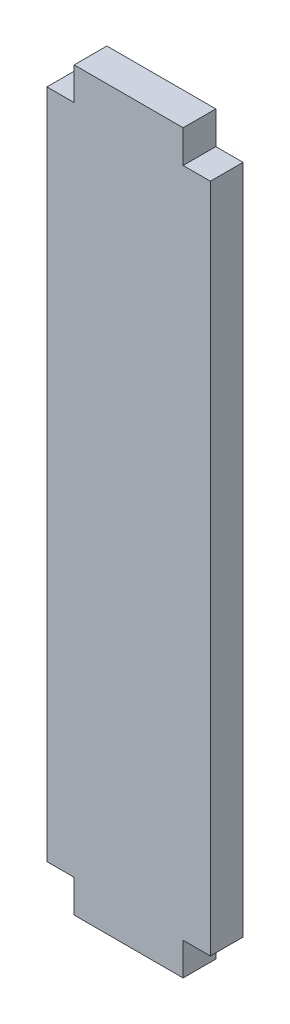
ISO-10303-21;
HEADER;
FILE_DESCRIPTION(('STEP AP214'),'2;1');
FILE_NAME('part.step','',(''),(''),'','','');
FILE_SCHEMA(('AUTOMOTIVE_DESIGN { 1 0 10303 214 1 1 1 1 }'));
ENDSEC;
DATA;
#1=APPLICATION_CONTEXT('core data for automotive mechanical design processes');
#2=APPLICATION_PROTOCOL_DEFINITION('international standard','automotive_design',2000,#1);
#3=PRODUCT_CONTEXT('',#1,'mechanical');
#4=PRODUCT('Part','Part','',(#3));
#5=PRODUCT_RELATED_PRODUCT_CATEGORY('part','',(#4));
#6=PRODUCT_DEFINITION_FORMATION('','',#4);
#7=PRODUCT_DEFINITION_CONTEXT('part definition',#1,'design');
#8=PRODUCT_DEFINITION('design','',#6,#7);
#9=PRODUCT_DEFINITION_SHAPE('','',#8);
#10=(LENGTH_UNIT() NAMED_UNIT(*) SI_UNIT(.MILLI.,.METRE.));
#11=(NAMED_UNIT(*) PLANE_ANGLE_UNIT() SI_UNIT($,.RADIAN.));
#12=(NAMED_UNIT(*) SI_UNIT($,.STERADIAN.) SOLID_ANGLE_UNIT());
#13=UNCERTAINTY_MEASURE_WITH_UNIT(LENGTH_MEASURE(1.E-05),#10,'distance_accuracy_value','');
#14=(GEOMETRIC_REPRESENTATION_CONTEXT(3) GLOBAL_UNCERTAINTY_ASSIGNED_CONTEXT((#13)) GLOBAL_UNIT_ASSIGNED_CONTEXT((#10,
#11,#12)) REPRESENTATION_CONTEXT('',''));
#15=CARTESIAN_POINT('',(0.,0.,0.));
#16=DIRECTION('',(0.,0.,1.));
#17=DIRECTION('',(1.,0.,0.));
#18=AXIS2_PLACEMENT_3D('',#15,#16,#17);
#19=CARTESIAN_POINT('',(0.,30.8,3.));
#20=DIRECTION('',(0.,-1.,0.));
#21=DIRECTION('',(0.,0.,-1.));
#22=AXIS2_PLACEMENT_3D('',#19,#20,#21);
#23=PLANE('',#22);
#24=DIRECTION('',(-1.,0.,0.));
#25=VECTOR('',#24,1.);
#26=CARTESIAN_POINT('',(0.,30.8,0.));
#27=LINE('',#26,#25);
#28=CARTESIAN_POINT('',(-5.00000000000001,30.8,0.));
#29=VERTEX_POINT('',#28);
#30=CARTESIAN_POINT('',(-7.50000000000001,30.8,0.));
#31=VERTEX_POINT('',#30);
#32=EDGE_CURVE('E196',#29,#31,#27,.T.);
#33=ORIENTED_EDGE('',*,*,#32,.T.);
#34=DIRECTION('',(0.,0.,-1.));
#35=VECTOR('',#34,1.);
#36=CARTESIAN_POINT('',(-7.50000000000001,30.8,3.));
#37=LINE('',#36,#35);
#38=CARTESIAN_POINT('',(-7.50000000000001,30.8,3.));
#39=VERTEX_POINT('',#38);
#40=EDGE_CURVE('E11',#39,#31,#37,.T.);
#41=ORIENTED_EDGE('',*,*,#40,.F.);
#42=DIRECTION('',(-1.,0.,0.));
#43=VECTOR('',#42,1.);
#44=CARTESIAN_POINT('',(0.,30.8,3.));
#45=LINE('',#44,#43);
#46=CARTESIAN_POINT('',(-5.00000000000001,30.8,3.));
#47=VERTEX_POINT('',#46);
#48=EDGE_CURVE('E283',#47,#39,#45,.T.);
#49=ORIENTED_EDGE('',*,*,#48,.F.);
#50=DIRECTION('',(0.,0.,-1.));
#51=VECTOR('',#50,1.);
#52=CARTESIAN_POINT('',(-5.00000000000001,30.8,3.));
#53=LINE('',#52,#51);
#54=EDGE_CURVE('E62',#47,#29,#53,.T.);
#55=ORIENTED_EDGE('',*,*,#54,.T.);
#56=EDGE_LOOP('',(#33,#41,#49,#55));
#57=FACE_BOUND('',#56,.T.);
#58=ADVANCED_FACE('F42',(#57),#23,.F.);
#59=CARTESIAN_POINT('',(-7.49999999999999,0.,3.));
#60=DIRECTION('',(1.,0.,0.));
#61=DIRECTION('',(0.,1.,0.));
#62=AXIS2_PLACEMENT_3D('',#59,#60,#61);
#63=PLANE('',#62);
#64=DIRECTION('',(0.,-1.,0.));
#65=VECTOR('',#64,1.);
#66=CARTESIAN_POINT('',(-7.49999999999999,0.,0.));
#67=LINE('',#66,#65);
#68=CARTESIAN_POINT('',(-7.49999999999999,-30.8,0.));
#69=VERTEX_POINT('',#68);
#70=EDGE_CURVE('E199',#31,#69,#67,.T.);
#71=ORIENTED_EDGE('',*,*,#70,.T.);
#72=DIRECTION('',(0.,0.,-1.));
#73=VECTOR('',#72,1.);
#74=CARTESIAN_POINT('',(-7.49999999999999,-30.8,3.));
#75=LINE('',#74,#73);
#76=CARTESIAN_POINT('',(-7.49999999999999,-30.8,3.));
#77=VERTEX_POINT('',#76);
#78=EDGE_CURVE('E51',#77,#69,#75,.T.);
#79=ORIENTED_EDGE('',*,*,#78,.F.);
#80=DIRECTION('',(0.,-1.,0.));
#81=VECTOR('',#80,1.);
#82=CARTESIAN_POINT('',(-7.49999999999999,0.,3.));
#83=LINE('',#82,#81);
#84=EDGE_CURVE('E126',#39,#77,#83,.T.);
#85=ORIENTED_EDGE('',*,*,#84,.F.);
#86=ORIENTED_EDGE('',*,*,#40,.T.);
#87=EDGE_LOOP('',(#71,#79,#85,#86));
#88=FACE_BOUND('',#87,.T.);
#89=ADVANCED_FACE('F267',(#88),#63,.F.);
#90=CARTESIAN_POINT('',(0.,-30.8,3.));
#91=DIRECTION('',(0.,-1.,0.));
#92=DIRECTION('',(1.,0.,0.));
#93=AXIS2_PLACEMENT_3D('',#90,#91,#92);
#94=PLANE('',#93);
#95=DIRECTION('',(-1.,0.,0.));
#96=VECTOR('',#95,1.);
#97=CARTESIAN_POINT('',(0.,-30.8,0.));
#98=LINE('',#97,#96);
#99=CARTESIAN_POINT('',(-4.99999999999999,-30.8,0.));
#100=VERTEX_POINT('',#99);
#101=EDGE_CURVE('E203',#100,#69,#98,.T.);
#102=ORIENTED_EDGE('',*,*,#101,.F.);
#103=DIRECTION('',(0.,0.,-1.));
#104=VECTOR('',#103,1.);
#105=CARTESIAN_POINT('',(-4.99999999999999,-30.8,3.));
#106=LINE('',#105,#104);
#107=CARTESIAN_POINT('',(-4.99999999999999,-30.8,3.));
#108=VERTEX_POINT('',#107);
#109=EDGE_CURVE('E256',#108,#100,#106,.T.);
#110=ORIENTED_EDGE('',*,*,#109,.F.);
#111=DIRECTION('',(-1.,0.,0.));
#112=VECTOR('',#111,1.);
#113=CARTESIAN_POINT('',(0.,-30.8,3.));
#114=LINE('',#113,#112);
#115=EDGE_CURVE('E266',#108,#77,#114,.T.);
#116=ORIENTED_EDGE('',*,*,#115,.T.);
#117=ORIENTED_EDGE('',*,*,#78,.T.);
#118=EDGE_LOOP('',(#102,#110,#116,#117));
#119=FACE_BOUND('',#118,.T.);
#120=ADVANCED_FACE('F264',(#119),#94,.T.);
#121=CARTESIAN_POINT('',(-5.,0.,3.));
#122=DIRECTION('',(-1.,0.,0.));
#123=DIRECTION('',(0.,-1.,0.));
#124=AXIS2_PLACEMENT_3D('',#121,#122,#123);
#125=PLANE('',#124);
#126=DIRECTION('',(0.,1.,0.));
#127=VECTOR('',#126,1.);
#128=CARTESIAN_POINT('',(-5.,0.,0.));
#129=LINE('',#128,#127);
#130=CARTESIAN_POINT('',(-4.99999999999999,-33.8,0.));
#131=VERTEX_POINT('',#130);
#132=EDGE_CURVE('E207',#131,#100,#129,.T.);
#133=ORIENTED_EDGE('',*,*,#132,.F.);
#134=DIRECTION('',(0.,0.,-1.));
#135=VECTOR('',#134,1.);
#136=CARTESIAN_POINT('',(-4.99999999999999,-33.8,3.));
#137=LINE('',#136,#135);
#138=CARTESIAN_POINT('',(-4.99999999999999,-33.8,3.));
#139=VERTEX_POINT('',#138);
#140=EDGE_CURVE('E253',#139,#131,#137,.T.);
#141=ORIENTED_EDGE('',*,*,#140,.F.);
#142=DIRECTION('',(0.,1.,0.));
#143=VECTOR('',#142,1.);
#144=CARTESIAN_POINT('',(-5.,0.,3.));
#145=LINE('',#144,#143);
#146=EDGE_CURVE('E192',#139,#108,#145,.T.);
#147=ORIENTED_EDGE('',*,*,#146,.T.);
#148=ORIENTED_EDGE('',*,*,#109,.T.);
#149=EDGE_LOOP('',(#133,#141,#147,#148));
#150=FACE_BOUND('',#149,.T.);
#151=ADVANCED_FACE('F275',(#150),#125,.T.);
#152=CARTESIAN_POINT('',(0.,-33.8,3.));
#153=DIRECTION('',(0.,-1.,0.));
#154=DIRECTION('',(0.,0.,-1.));
#155=AXIS2_PLACEMENT_3D('',#152,#153,#154);
#156=PLANE('',#155);
#157=DIRECTION('',(-1.,0.,0.));
#158=VECTOR('',#157,1.);
#159=CARTESIAN_POINT('',(0.,-33.8,0.));
#160=LINE('',#159,#158);
#161=CARTESIAN_POINT('',(5.,-33.8,0.));
#162=VERTEX_POINT('',#161);
#163=EDGE_CURVE('E211',#162,#131,#160,.T.);
#164=ORIENTED_EDGE('',*,*,#163,.F.);
#165=DIRECTION('',(0.,0.,-1.));
#166=VECTOR('',#165,1.);
#167=CARTESIAN_POINT('',(5.,-33.8,3.));
#168=LINE('',#167,#166);
#169=CARTESIAN_POINT('',(5.,-33.8,3.));
#170=VERTEX_POINT('',#169);
#171=EDGE_CURVE('E250',#170,#162,#168,.T.);
#172=ORIENTED_EDGE('',*,*,#171,.F.);
#173=DIRECTION('',(-1.,0.,0.));
#174=VECTOR('',#173,1.);
#175=CARTESIAN_POINT('',(0.,-33.8,3.));
#176=LINE('',#175,#174);
#177=EDGE_CURVE('E282',#170,#139,#176,.T.);
#178=ORIENTED_EDGE('',*,*,#177,.T.);
#179=ORIENTED_EDGE('',*,*,#140,.T.);
#180=EDGE_LOOP('',(#164,#172,#178,#179));
#181=FACE_BOUND('',#180,.T.);
#182=ADVANCED_FACE('F313',(#181),#156,.T.);
#183=CARTESIAN_POINT('',(5.,0.,3.));
#184=DIRECTION('',(-1.,0.,0.));
#185=DIRECTION('',(0.,-1.,0.));
#186=AXIS2_PLACEMENT_3D('',#183,#184,#185);
#187=PLANE('',#186);
#188=DIRECTION('',(0.,1.,0.));
#189=VECTOR('',#188,1.);
#190=CARTESIAN_POINT('',(5.,0.,0.));
#191=LINE('',#190,#189);
#192=CARTESIAN_POINT('',(5.,-30.8,0.));
#193=VERTEX_POINT('',#192);
#194=EDGE_CURVE('E216',#162,#193,#191,.T.);
#195=ORIENTED_EDGE('',*,*,#194,.T.);
#196=DIRECTION('',(0.,0.,-1.));
#197=VECTOR('',#196,1.);
#198=CARTESIAN_POINT('',(5.,-30.8,3.));
#199=LINE('',#198,#197);
#200=CARTESIAN_POINT('',(5.,-30.8,3.));
#201=VERTEX_POINT('',#200);
#202=EDGE_CURVE('E246',#201,#193,#199,.T.);
#203=ORIENTED_EDGE('',*,*,#202,.F.);
#204=DIRECTION('',(0.,1.,0.));
#205=VECTOR('',#204,1.);
#206=CARTESIAN_POINT('',(5.,0.,3.));
#207=LINE('',#206,#205);
#208=EDGE_CURVE('E174',#170,#201,#207,.T.);
#209=ORIENTED_EDGE('',*,*,#208,.F.);
#210=ORIENTED_EDGE('',*,*,#171,.T.);
#211=EDGE_LOOP('',(#195,#203,#209,#210));
#212=FACE_BOUND('',#211,.T.);
#213=ADVANCED_FACE('F316',(#212),#187,.F.);
#214=CARTESIAN_POINT('',(0.,-30.8,3.));
#215=DIRECTION('',(0.,1.,0.));
#216=DIRECTION('',(-1.,0.,0.));
#217=AXIS2_PLACEMENT_3D('',#214,#215,#216);
#218=PLANE('',#217);
#219=DIRECTION('',(1.,0.,0.));
#220=VECTOR('',#219,1.);
#221=CARTESIAN_POINT('',(0.,-30.8,0.));
#222=LINE('',#221,#220);
#223=CARTESIAN_POINT('',(7.50000000000001,-30.8,0.));
#224=VERTEX_POINT('',#223);
#225=EDGE_CURVE('E219',#193,#224,#222,.T.);
#226=ORIENTED_EDGE('',*,*,#225,.T.);
#227=DIRECTION('',(0.,0.,-1.));
#228=VECTOR('',#227,1.);
#229=CARTESIAN_POINT('',(7.50000000000001,-30.8,3.));
#230=LINE('',#229,#228);
#231=CARTESIAN_POINT('',(7.50000000000001,-30.8,3.));
#232=VERTEX_POINT('',#231);
#233=EDGE_CURVE('E243',#232,#224,#230,.T.);
#234=ORIENTED_EDGE('',*,*,#233,.F.);
#235=DIRECTION('',(1.,0.,0.));
#236=VECTOR('',#235,1.);
#237=CARTESIAN_POINT('',(0.,-30.8,3.));
#238=LINE('',#237,#236);
#239=EDGE_CURVE('E290',#201,#232,#238,.T.);
#240=ORIENTED_EDGE('',*,*,#239,.F.);
#241=ORIENTED_EDGE('',*,*,#202,.T.);
#242=EDGE_LOOP('',(#226,#234,#240,#241));
#243=FACE_BOUND('',#242,.T.);
#244=ADVANCED_FACE('F318',(#243),#218,.F.);
#245=CARTESIAN_POINT('',(7.5,0.,3.));
#246=DIRECTION('',(1.,0.,0.));
#247=DIRECTION('',(0.,1.,0.));
#248=AXIS2_PLACEMENT_3D('',#245,#246,#247);
#249=PLANE('',#248);
#250=DIRECTION('',(0.,-1.,0.));
#251=VECTOR('',#250,1.);
#252=CARTESIAN_POINT('',(7.5,0.,0.));
#253=LINE('',#252,#251);
#254=CARTESIAN_POINT('',(7.49999999999999,30.8,0.));
#255=VERTEX_POINT('',#254);
#256=EDGE_CURVE('E223',#255,#224,#253,.T.);
#257=ORIENTED_EDGE('',*,*,#256,.F.);
#258=DIRECTION('',(0.,0.,-1.));
#259=VECTOR('',#258,1.);
#260=CARTESIAN_POINT('',(7.49999999999999,30.8,3.));
#261=LINE('',#260,#259);
#262=CARTESIAN_POINT('',(7.49999999999999,30.8,3.));
#263=VERTEX_POINT('',#262);
#264=EDGE_CURVE('E240',#263,#255,#261,.T.);
#265=ORIENTED_EDGE('',*,*,#264,.F.);
#266=DIRECTION('',(0.,-1.,0.));
#267=VECTOR('',#266,1.);
#268=CARTESIAN_POINT('',(7.5,0.,3.));
#269=LINE('',#268,#267);
#270=EDGE_CURVE('E292',#263,#232,#269,.T.);
#271=ORIENTED_EDGE('',*,*,#270,.T.);
#272=ORIENTED_EDGE('',*,*,#233,.T.);
#273=EDGE_LOOP('',(#257,#265,#271,#272));
#274=FACE_BOUND('',#273,.T.);
#275=ADVANCED_FACE('F321',(#274),#249,.T.);
#276=CARTESIAN_POINT('',(0.,30.8,3.));
#277=DIRECTION('',(0.,1.,0.));
#278=DIRECTION('',(-1.,0.,0.));
#279=AXIS2_PLACEMENT_3D('',#276,#277,#278);
#280=PLANE('',#279);
#281=DIRECTION('',(1.,0.,0.));
#282=VECTOR('',#281,1.);
#283=CARTESIAN_POINT('',(0.,30.8,0.));
#284=LINE('',#283,#282);
#285=CARTESIAN_POINT('',(4.99999999999998,30.8,0.));
#286=VERTEX_POINT('',#285);
#287=EDGE_CURVE('E227',#286,#255,#284,.T.);
#288=ORIENTED_EDGE('',*,*,#287,.F.);
#289=DIRECTION('',(0.,0.,-1.));
#290=VECTOR('',#289,1.);
#291=CARTESIAN_POINT('',(4.99999999999998,30.8,3.));
#292=LINE('',#291,#290);
#293=CARTESIAN_POINT('',(4.99999999999998,30.8,3.));
#294=VERTEX_POINT('',#293);
#295=EDGE_CURVE('E183',#294,#286,#292,.T.);
#296=ORIENTED_EDGE('',*,*,#295,.F.);
#297=DIRECTION('',(1.,0.,0.));
#298=VECTOR('',#297,1.);
#299=CARTESIAN_POINT('',(0.,30.8,3.));
#300=LINE('',#299,#298);
#301=EDGE_CURVE('E170',#294,#263,#300,.T.);
#302=ORIENTED_EDGE('',*,*,#301,.T.);
#303=ORIENTED_EDGE('',*,*,#264,.T.);
#304=EDGE_LOOP('',(#288,#296,#302,#303));
#305=FACE_BOUND('',#304,.T.);
#306=ADVANCED_FACE('F299',(#305),#280,.T.);
#307=CARTESIAN_POINT('',(4.99999999999998,33.8,0.));
#308=VERTEX_POINT('',#307);
#309=EDGE_CURVE('E179',#286,#308,#191,.T.);
#310=ORIENTED_EDGE('',*,*,#309,.T.);
#311=DIRECTION('',(0.,0.,-1.));
#312=VECTOR('',#311,1.);
#313=CARTESIAN_POINT('',(4.99999999999998,33.8,3.));
#314=LINE('',#313,#312);
#315=CARTESIAN_POINT('',(4.99999999999998,33.8,3.));
#316=VERTEX_POINT('',#315);
#317=EDGE_CURVE('E176',#316,#308,#314,.T.);
#318=ORIENTED_EDGE('',*,*,#317,.F.);
#319=EDGE_CURVE('E162',#294,#316,#207,.T.);
#320=ORIENTED_EDGE('',*,*,#319,.F.);
#321=ORIENTED_EDGE('',*,*,#295,.T.);
#322=EDGE_LOOP('',(#310,#318,#320,#321));
#323=FACE_BOUND('',#322,.T.);
#324=ADVANCED_FACE('F177',(#323),#187,.F.);
#325=CARTESIAN_POINT('',(0.,33.8,3.));
#326=DIRECTION('',(0.,-1.,0.));
#327=DIRECTION('',(1.,0.,0.));
#328=AXIS2_PLACEMENT_3D('',#325,#326,#327);
#329=PLANE('',#328);
#330=DIRECTION('',(-1.,0.,0.));
#331=VECTOR('',#330,1.);
#332=CARTESIAN_POINT('',(0.,33.8,0.));
#333=LINE('',#332,#331);
#334=CARTESIAN_POINT('',(-5.00000000000001,33.8,0.));
#335=VERTEX_POINT('',#334);
#336=EDGE_CURVE('E231',#308,#335,#333,.T.);
#337=ORIENTED_EDGE('',*,*,#336,.T.);
#338=DIRECTION('',(0.,0.,-1.));
#339=VECTOR('',#338,1.);
#340=CARTESIAN_POINT('',(-5.00000000000001,33.8,3.));
#341=LINE('',#340,#339);
#342=CARTESIAN_POINT('',(-5.00000000000001,33.8,3.));
#343=VERTEX_POINT('',#342);
#344=EDGE_CURVE('E113',#343,#335,#341,.T.);
#345=ORIENTED_EDGE('',*,*,#344,.F.);
#346=DIRECTION('',(-1.,0.,0.));
#347=VECTOR('',#346,1.);
#348=CARTESIAN_POINT('',(0.,33.8,3.));
#349=LINE('',#348,#347);
#350=EDGE_CURVE('E167',#316,#343,#349,.T.);
#351=ORIENTED_EDGE('',*,*,#350,.F.);
#352=ORIENTED_EDGE('',*,*,#317,.T.);
#353=EDGE_LOOP('',(#337,#345,#351,#352));
#354=FACE_BOUND('',#353,.T.);
#355=ADVANCED_FACE('F185',(#354),#329,.F.);
#356=EDGE_CURVE('E212',#29,#335,#129,.T.);
#357=ORIENTED_EDGE('',*,*,#356,.F.);
#358=ORIENTED_EDGE('',*,*,#54,.F.);
#359=EDGE_CURVE('E187',#47,#343,#145,.T.);
#360=ORIENTED_EDGE('',*,*,#359,.T.);
#361=ORIENTED_EDGE('',*,*,#344,.T.);
#362=EDGE_LOOP('',(#357,#358,#360,#361));
#363=FACE_BOUND('',#362,.T.);
#364=ADVANCED_FACE('F331',(#363),#125,.T.);
#365=CARTESIAN_POINT('',(0.,0.,3.));
#366=DIRECTION('',(0.,0.,1.));
#367=DIRECTION('',(1.,0.,0.));
#368=AXIS2_PLACEMENT_3D('',#365,#366,#367);
#369=PLANE('',#368);
#370=ORIENTED_EDGE('',*,*,#48,.T.);
#371=ORIENTED_EDGE('',*,*,#84,.T.);
#372=ORIENTED_EDGE('',*,*,#115,.F.);
#373=ORIENTED_EDGE('',*,*,#146,.F.);
#374=ORIENTED_EDGE('',*,*,#177,.F.);
#375=ORIENTED_EDGE('',*,*,#208,.T.);
#376=ORIENTED_EDGE('',*,*,#239,.T.);
#377=ORIENTED_EDGE('',*,*,#270,.F.);
#378=ORIENTED_EDGE('',*,*,#301,.F.);
#379=ORIENTED_EDGE('',*,*,#319,.T.);
#380=ORIENTED_EDGE('',*,*,#350,.T.);
#381=ORIENTED_EDGE('',*,*,#359,.F.);
#382=EDGE_LOOP('',(#370,#371,#372,#373,#374,#375,#376,#377,#378,#379,#380,#381));
#383=FACE_BOUND('',#382,.T.);
#384=ADVANCED_FACE('F164',(#383),#369,.T.);
#385=CARTESIAN_POINT('',(0.,0.,0.));
#386=DIRECTION('',(0.,0.,1.));
#387=DIRECTION('',(1.,0.,0.));
#388=AXIS2_PLACEMENT_3D('',#385,#386,#387);
#389=PLANE('',#388);
#390=ORIENTED_EDGE('',*,*,#32,.F.);
#391=ORIENTED_EDGE('',*,*,#356,.T.);
#392=ORIENTED_EDGE('',*,*,#336,.F.);
#393=ORIENTED_EDGE('',*,*,#309,.F.);
#394=ORIENTED_EDGE('',*,*,#287,.T.);
#395=ORIENTED_EDGE('',*,*,#256,.T.);
#396=ORIENTED_EDGE('',*,*,#225,.F.);
#397=ORIENTED_EDGE('',*,*,#194,.F.);
#398=ORIENTED_EDGE('',*,*,#163,.T.);
#399=ORIENTED_EDGE('',*,*,#132,.T.);
#400=ORIENTED_EDGE('',*,*,#101,.T.);
#401=ORIENTED_EDGE('',*,*,#70,.F.);
#402=EDGE_LOOP('',(#390,#391,#392,#393,#394,#395,#396,#397,#398,#399,#400,#401));
#403=FACE_BOUND('',#402,.T.);
#404=ADVANCED_FACE('F270',(#403),#389,.F.);
#405=CLOSED_SHELL('',(#58,#89,#120,#151,#182,#213,#244,#275,#306,#324,#355,#364,#384,#404));
#406=MANIFOLD_SOLID_BREP('B2',#405);
#407=ADVANCED_BREP_SHAPE_REPRESENTATION('',(#18,#406),#14);
#408=SHAPE_DEFINITION_REPRESENTATION(#9,#407);
ENDSEC;
END-ISO-10303-21;
